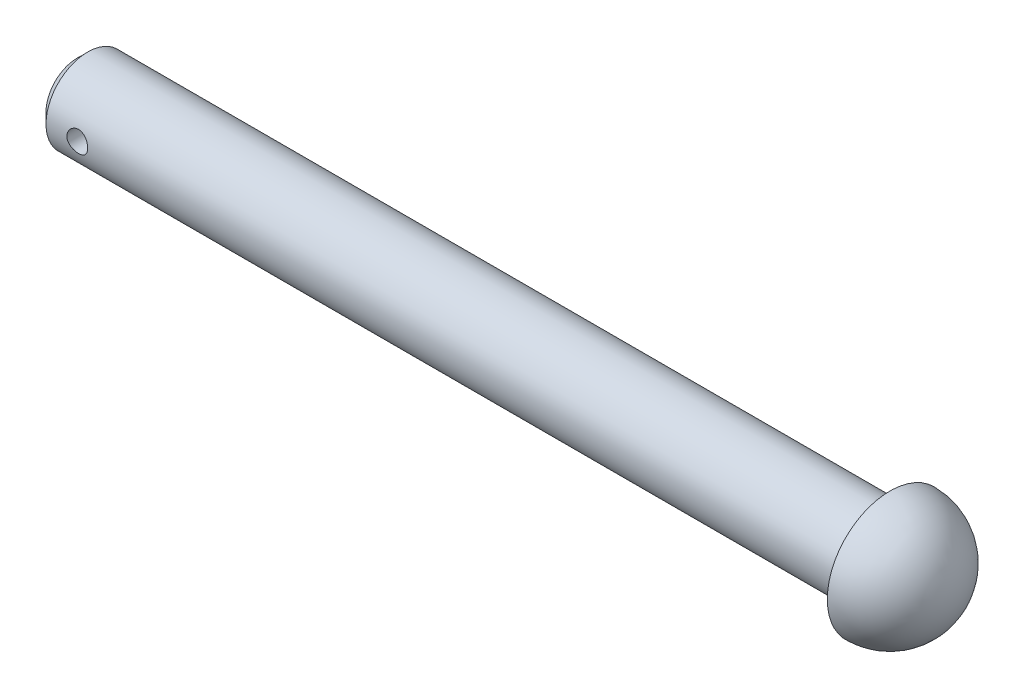
ISO-10303-21;
HEADER;
FILE_DESCRIPTION(('STEP AP214'),'2;1');
FILE_NAME('part.step','',(''),(''),'','','');
FILE_SCHEMA(('AUTOMOTIVE_DESIGN { 1 0 10303 214 1 1 1 1 }'));
ENDSEC;
DATA;
#1=APPLICATION_CONTEXT('core data for automotive mechanical design processes');
#2=APPLICATION_PROTOCOL_DEFINITION('international standard','automotive_design',2000,#1);
#3=PRODUCT_CONTEXT('',#1,'mechanical');
#4=PRODUCT('Part','Part','',(#3));
#5=PRODUCT_RELATED_PRODUCT_CATEGORY('part','',(#4));
#6=PRODUCT_DEFINITION_FORMATION('','',#4);
#7=PRODUCT_DEFINITION_CONTEXT('part definition',#1,'design');
#8=PRODUCT_DEFINITION('design','',#6,#7);
#9=PRODUCT_DEFINITION_SHAPE('','',#8);
#10=(LENGTH_UNIT() NAMED_UNIT(*) SI_UNIT(.MILLI.,.METRE.));
#11=(NAMED_UNIT(*) PLANE_ANGLE_UNIT() SI_UNIT($,.RADIAN.));
#12=(NAMED_UNIT(*) SI_UNIT($,.STERADIAN.) SOLID_ANGLE_UNIT());
#13=UNCERTAINTY_MEASURE_WITH_UNIT(LENGTH_MEASURE(1.E-05),#10,'distance_accuracy_value','');
#14=(GEOMETRIC_REPRESENTATION_CONTEXT(3) GLOBAL_UNCERTAINTY_ASSIGNED_CONTEXT((#13)) GLOBAL_UNIT_ASSIGNED_CONTEXT((#10,
#11,#12)) REPRESENTATION_CONTEXT('',''));
#15=CARTESIAN_POINT('',(0.,0.,0.));
#16=DIRECTION('',(0.,0.,1.));
#17=DIRECTION('',(1.,0.,0.));
#18=AXIS2_PLACEMENT_3D('',#15,#16,#17);
#19=CARTESIAN_POINT('',(-11.4922423671697,0.,0.));
#20=DIRECTION('',(-1.,0.,0.));
#21=DIRECTION('',(0.,0.,1.));
#22=AXIS2_PLACEMENT_3D('',#19,#20,#21);
#23=PLANE('',#22);
#24=CARTESIAN_POINT('',(-11.4922423671697,0.,0.));
#25=DIRECTION('',(-1.,0.,0.));
#26=DIRECTION('',(0.,0.,1.));
#27=AXIS2_PLACEMENT_3D('',#24,#25,#26);
#28=CIRCLE('',#27,1.5);
#29=CARTESIAN_POINT('',(-11.4922423671697,0.,1.5));
#30=VERTEX_POINT('',#29);
#31=EDGE_CURVE('E54',#30,#30,#28,.T.);
#32=ORIENTED_EDGE('',*,*,#31,.T.);
#33=EDGE_LOOP('',(#32));
#34=FACE_BOUND('',#33,.T.);
#35=ADVANCED_FACE('F45',(#34),#23,.T.);
#36=CARTESIAN_POINT('',(-20.421686746988,0.,0.));
#37=DIRECTION('',(-1.,0.,0.));
#38=DIRECTION('',(0.,0.,1.));
#39=AXIS2_PLACEMENT_3D('',#36,#37,#38);
#40=CYLINDRICAL_SURFACE('',#39,2.);
#41=CARTESIAN_POINT('',(-10.9922423671697,0.,0.));
#42=DIRECTION('',(-1.,0.,0.));
#43=DIRECTION('',(0.,0.,1.));
#44=AXIS2_PLACEMENT_3D('',#41,#42,#43);
#45=CIRCLE('',#44,2.);
#46=CARTESIAN_POINT('',(-10.9922423671697,0.,2.));
#47=VERTEX_POINT('',#46);
#48=EDGE_CURVE('E10',#47,#47,#45,.F.);
#49=ORIENTED_EDGE('',*,*,#48,.T.);
#50=EDGE_LOOP('',(#49));
#51=FACE_BOUND('',#50,.T.);
#52=CARTESIAN_POINT('',(-8.99224236716964,0.,2.));
#53=CARTESIAN_POINT('',(-8.9922431424157,0.0276253628899104,1.99999953289338));
#54=CARTESIAN_POINT('',(-8.99453955076091,0.0552593859435878,1.99942192710609));
#55=CARTESIAN_POINT('',(-9.00365075093864,0.109735441256844,1.99717371276631));
#56=CARTESIAN_POINT('',(-9.01046810368226,0.13657701562358,1.99550248473323));
#57=CARTESIAN_POINT('',(-9.02838878499034,0.188673624060859,1.99125208777347));
#58=CARTESIAN_POINT('',(-9.0394869667414,0.213930521143335,1.98867400947362));
#59=CARTESIAN_POINT('',(-9.06563616385125,0.262224043968142,1.98288447935864));
#60=CARTESIAN_POINT('',(-9.08068731254262,0.28526059478292,1.97967300618017));
#61=CARTESIAN_POINT('',(-9.11464263038771,0.328933975766973,1.97289137863934));
#62=CARTESIAN_POINT('',(-9.13361289215604,0.34951856335369,1.96931569049511));
#63=CARTESIAN_POINT('',(-9.17472643547261,0.387249642401101,1.96224540039176));
#64=CARTESIAN_POINT('',(-9.19687007481847,0.404395745649712,1.95875080762783));
#65=CARTESIAN_POINT('',(-9.24410744274879,0.435008847599677,1.9521825856657));
#66=CARTESIAN_POINT('',(-9.26924011077311,0.448417405308452,1.94911598156868));
#67=CARTESIAN_POINT('',(-9.32149183772243,0.470798969516843,1.94383164937408));
#68=CARTESIAN_POINT('',(-9.34861057827823,0.479772685146445,1.94161378557596));
#69=CARTESIAN_POINT('',(-9.4034901999038,0.492851612268098,1.93833492239184));
#70=CARTESIAN_POINT('',(-9.43122733251958,0.497050756111114,1.93725163691809));
#71=CARTESIAN_POINT('',(-9.48703189017431,0.500753925022618,1.9362978751258));
#72=CARTESIAN_POINT('',(-9.51509926073585,0.500258713939327,1.93642720149548));
#73=CARTESIAN_POINT('',(-9.5700476364178,0.494662174879761,1.93786401832206));
#74=CARTESIAN_POINT('',(-9.59694090765801,0.489672780063508,1.93914287667293));
#75=CARTESIAN_POINT('',(-9.64949605080674,0.475408062301036,1.94268903225495));
#76=CARTESIAN_POINT('',(-9.67515783484597,0.466132434023142,1.94495639990232));
#77=CARTESIAN_POINT('',(-9.72482170592033,0.443463159312385,1.95025037968062));
#78=CARTESIAN_POINT('',(-9.74880442443283,0.430028889077638,1.95328442489807));
#79=CARTESIAN_POINT('',(-9.79421527042192,0.399452092004985,1.95976570282129));
#80=CARTESIAN_POINT('',(-9.81564294985873,0.382308916269613,1.96321300778245));
#81=CARTESIAN_POINT('',(-9.85597690573444,0.344221141560406,1.9702529351326));
#82=CARTESIAN_POINT('',(-9.87479386385676,0.323182086055287,1.9738468982599));
#83=CARTESIAN_POINT('',(-9.90864944799095,0.278203972501234,1.98068655192929));
#84=CARTESIAN_POINT('',(-9.92368795859083,0.254264825902648,1.98393223183138));
#85=CARTESIAN_POINT('',(-9.94959256257777,0.204038629560464,1.98972577364727));
#86=CARTESIAN_POINT('',(-9.96044414725445,0.177743797736208,1.99227120042575));
#87=CARTESIAN_POINT('',(-9.9775481357395,0.123625336047628,1.99635972330473));
#88=CARTESIAN_POINT('',(-9.98380141930902,0.095801999716828,1.99790301113094));
#89=CARTESIAN_POINT('',(-9.99139488902259,0.0401799901300085,1.99978499757125));
#90=CARTESIAN_POINT('',(-9.99285670919474,0.0123989066627362,2.00015351169426));
#91=CARTESIAN_POINT('',(-9.99115936648448,-0.0430109582671696,1.9997293493815));
#92=CARTESIAN_POINT('',(-9.98800061956993,-0.0706397532148651,1.99893677747282));
#93=CARTESIAN_POINT('',(-9.97725206437252,-0.124538089592164,1.99629860375786));
#94=CARTESIAN_POINT('',(-9.96972861267732,-0.150821706322918,1.99446878061937));
#95=CARTESIAN_POINT('',(-9.95054000582683,-0.201752430817504,1.98996235544711));
#96=CARTESIAN_POINT('',(-9.93887443239859,-0.226399373010878,1.98728566789964));
#97=CARTESIAN_POINT('',(-9.91149699087807,-0.273841044809949,1.98131102642103));
#98=CARTESIAN_POINT('',(-9.89571699637072,-0.29659514727861,1.97800289122311));
#99=CARTESIAN_POINT('',(-9.86064573090399,-0.339175537881082,1.97114836395806));
#100=CARTESIAN_POINT('',(-9.84135385396401,-0.35900131965767,1.96760193083902));
#101=CARTESIAN_POINT('',(-9.79924171355482,-0.39566352269091,1.96056318986924));
#102=CARTESIAN_POINT('',(-9.77634646616884,-0.412414622540678,1.95707434729094));
#103=CARTESIAN_POINT('',(-9.72799815568107,-0.4418369196709,1.95064292792413));
#104=CARTESIAN_POINT('',(-9.70254520618306,-0.454508298052646,1.94770032689009));
#105=CARTESIAN_POINT('',(-9.64994045969862,-0.475317140203098,1.94272698244888));
#106=CARTESIAN_POINT('',(-9.62279982438831,-0.483481465551356,1.94069085097302));
#107=CARTESIAN_POINT('',(-9.56747248787327,-0.495115219984594,1.93775581363394));
#108=CARTESIAN_POINT('',(-9.53928601682548,-0.49858567582622,1.93685665906645));
#109=CARTESIAN_POINT('',(-9.48353535921791,-0.500679530111332,1.93631633734652));
#110=CARTESIAN_POINT('',(-9.4559765554614,-0.49943929926004,1.93663977576088));
#111=CARTESIAN_POINT('',(-9.40147440428032,-0.492459092770956,1.93842636335948));
#112=CARTESIAN_POINT('',(-9.37453104449843,-0.486719207562257,1.93988948963952));
#113=CARTESIAN_POINT('',(-9.32217288081451,-0.470977106480932,1.94377086894241));
#114=CARTESIAN_POINT('',(-9.29674993208958,-0.461000468226793,1.94618338412103));
#115=CARTESIAN_POINT('',(-9.24792057293175,-0.437088304535025,1.95169251908276));
#116=CARTESIAN_POINT('',(-9.22451444277401,-0.423152230011397,1.95478923373591));
#117=CARTESIAN_POINT('',(-9.1797241575023,-0.391289249545713,1.96141878087837));
#118=CARTESIAN_POINT('',(-9.15840867602832,-0.373267720970752,1.96496088277252));
#119=CARTESIAN_POINT('',(-9.11906001890451,-0.333929790396579,1.97202675748762));
#120=CARTESIAN_POINT('',(-9.10102762379865,-0.312612607087049,1.97555052575686));
#121=CARTESIAN_POINT('',(-9.06843859764811,-0.266822528900864,1.98225885215888));
#122=CARTESIAN_POINT('',(-9.05395082927912,-0.242299474105463,1.98543611121956));
#123=CARTESIAN_POINT('',(-9.02932654618947,-0.191088686503492,1.99101641658373));
#124=CARTESIAN_POINT('',(-9.01918691362013,-0.16440252114558,1.9934200173326));
#125=CARTESIAN_POINT('',(-9.00505175705976,-0.114803417747824,1.99682686521847));
#126=CARTESIAN_POINT('',(-9.00025861948516,-0.092126723636023,1.9980086168423));
#127=CARTESIAN_POINT('',(-8.99385371929566,-0.0463020238454279,1.99959535077316));
#128=CARTESIAN_POINT('',(-8.99224171740121,-0.0231540537475388,2.00000039150298));
#129=CARTESIAN_POINT('',(-8.99224236716964,0.,2.));
#130=B_SPLINE_CURVE_WITH_KNOTS('',3,(#52,#53,#54,#55,#56,#57,#58,#59,#60,#61,#62,#63,#64,#65,
#66,#67,#68,#69,#70,#71,#72,#73,#74,#75,#76,#77,#78,#79,#80,#81,#82,#83,#84,#85,#86,#87,#88,#89,
#90,#91,#92,#93,#94,#95,#96,#97,#98,#99,#100,#101,#102,#103,#104,#105,#106,#107,#108,#109,#110,
#111,#112,#113,#114,#115,#116,#117,#118,#119,#120,#121,#122,#123,#124,#125,#126,#127,#128,#129),
.UNSPECIFIED.,.T.,.F.,(4,2,2,2,2,2,2,2,2,2,2,2,2,2,2,2,2,2,2,2,2,2,2,2,2,2,2,2,2,2,2,2,2,2,2,2,
2,2,4),(0.,0.08279123749063,0.165629412587966,0.248368300762035,0.331109980056443,
0.415381451457129,0.499662431933539,0.585195491819355,0.670714870564561,0.75452098366477,
0.838313460375658,0.920074990023394,1.0018423448868,1.08443509291293,1.16704230278721,
1.25200500323007,1.33697029852749,1.42222743003038,1.50746824562881,1.59052769649759,
1.67357967037581,1.75540091504679,1.83723042440764,1.92051195855117,2.0038078766934,
2.08914836401492,2.17448506249836,2.25930751538012,2.34411141084136,2.42647926799538,
2.50884546985345,2.59072133519816,2.67260856045634,2.75663192136637,2.84067523256806,
2.92624061833196,3.01174454607117,3.08114080980717,3.1505318534768),.UNSPECIFIED.);
#131=CARTESIAN_POINT('',(-8.99224236716964,0.,2.));
#132=VERTEX_POINT('',#131);
#133=EDGE_CURVE('E67',#132,#132,#130,.T.);
#134=ORIENTED_EDGE('',*,*,#133,.F.);
#135=EDGE_LOOP('',(#134));
#136=FACE_BOUND('',#135,.T.);
#137=CARTESIAN_POINT('',(-8.99224236716964,0.,-2.));
#138=CARTESIAN_POINT('',(-8.9922431424157,-0.0276253628899104,-1.99999953289338));
#139=CARTESIAN_POINT('',(-8.99453955076091,-0.0552593859435878,-1.99942192710609));
#140=CARTESIAN_POINT('',(-9.00365075093864,-0.109735441256844,-1.99717371276631));
#141=CARTESIAN_POINT('',(-9.01046810368226,-0.13657701562358,-1.99550248473323));
#142=CARTESIAN_POINT('',(-9.02838878499034,-0.188673624060859,-1.99125208777347));
#143=CARTESIAN_POINT('',(-9.0394869667414,-0.213930521143335,-1.98867400947362));
#144=CARTESIAN_POINT('',(-9.06563616385125,-0.262224043968142,-1.98288447935864));
#145=CARTESIAN_POINT('',(-9.08068731254262,-0.28526059478292,-1.97967300618017));
#146=CARTESIAN_POINT('',(-9.11464263038771,-0.328933975766973,-1.97289137863934));
#147=CARTESIAN_POINT('',(-9.13361289215604,-0.34951856335369,-1.96931569049511));
#148=CARTESIAN_POINT('',(-9.17472643547261,-0.387249642401101,-1.96224540039176));
#149=CARTESIAN_POINT('',(-9.19687007481847,-0.404395745649712,-1.95875080762783));
#150=CARTESIAN_POINT('',(-9.24410744274879,-0.435008847599677,-1.9521825856657));
#151=CARTESIAN_POINT('',(-9.26924011077311,-0.448417405308452,-1.94911598156868));
#152=CARTESIAN_POINT('',(-9.32149183772243,-0.470798969516843,-1.94383164937408));
#153=CARTESIAN_POINT('',(-9.34861057827823,-0.479772685146445,-1.94161378557596));
#154=CARTESIAN_POINT('',(-9.4034901999038,-0.492851612268098,-1.93833492239184));
#155=CARTESIAN_POINT('',(-9.43122733251958,-0.497050756111114,-1.93725163691809));
#156=CARTESIAN_POINT('',(-9.48703189017431,-0.500753925022618,-1.9362978751258));
#157=CARTESIAN_POINT('',(-9.51509926073585,-0.500258713939327,-1.93642720149548));
#158=CARTESIAN_POINT('',(-9.5700476364178,-0.494662174879761,-1.93786401832206));
#159=CARTESIAN_POINT('',(-9.59694090765801,-0.489672780063508,-1.93914287667293));
#160=CARTESIAN_POINT('',(-9.64949605080674,-0.475408062301036,-1.94268903225495));
#161=CARTESIAN_POINT('',(-9.67515783484597,-0.466132434023142,-1.94495639990232));
#162=CARTESIAN_POINT('',(-9.72482170592033,-0.443463159312385,-1.95025037968062));
#163=CARTESIAN_POINT('',(-9.74880442443283,-0.430028889077638,-1.95328442489807));
#164=CARTESIAN_POINT('',(-9.79421527042192,-0.399452092004985,-1.95976570282129));
#165=CARTESIAN_POINT('',(-9.81564294985873,-0.382308916269613,-1.96321300778245));
#166=CARTESIAN_POINT('',(-9.85597690573444,-0.344221141560406,-1.9702529351326));
#167=CARTESIAN_POINT('',(-9.87479386385676,-0.323182086055287,-1.9738468982599));
#168=CARTESIAN_POINT('',(-9.90864944799095,-0.278203972501234,-1.98068655192929));
#169=CARTESIAN_POINT('',(-9.92368795859083,-0.254264825902648,-1.98393223183138));
#170=CARTESIAN_POINT('',(-9.94959256257777,-0.204038629560464,-1.98972577364727));
#171=CARTESIAN_POINT('',(-9.96044414725445,-0.177743797736208,-1.99227120042575));
#172=CARTESIAN_POINT('',(-9.9775481357395,-0.123625336047628,-1.99635972330473));
#173=CARTESIAN_POINT('',(-9.98380141930902,-0.095801999716828,-1.99790301113094));
#174=CARTESIAN_POINT('',(-9.99139488902259,-0.0401799901300085,-1.99978499757125));
#175=CARTESIAN_POINT('',(-9.99285670919474,-0.0123989066627362,-2.00015351169426));
#176=CARTESIAN_POINT('',(-9.99115936648448,0.0430109582671696,-1.9997293493815));
#177=CARTESIAN_POINT('',(-9.98800061956993,0.0706397532148651,-1.99893677747282));
#178=CARTESIAN_POINT('',(-9.97725206437252,0.124538089592164,-1.99629860375786));
#179=CARTESIAN_POINT('',(-9.96972861267732,0.150821706322918,-1.99446878061937));
#180=CARTESIAN_POINT('',(-9.95054000582683,0.201752430817504,-1.98996235544711));
#181=CARTESIAN_POINT('',(-9.93887443239859,0.226399373010878,-1.98728566789964));
#182=CARTESIAN_POINT('',(-9.91149699087807,0.273841044809949,-1.98131102642103));
#183=CARTESIAN_POINT('',(-9.89571699637072,0.29659514727861,-1.97800289122311));
#184=CARTESIAN_POINT('',(-9.86064573090399,0.339175537881082,-1.97114836395806));
#185=CARTESIAN_POINT('',(-9.84135385396401,0.35900131965767,-1.96760193083902));
#186=CARTESIAN_POINT('',(-9.79924171355482,0.39566352269091,-1.96056318986924));
#187=CARTESIAN_POINT('',(-9.77634646616884,0.412414622540678,-1.95707434729094));
#188=CARTESIAN_POINT('',(-9.72799815568107,0.4418369196709,-1.95064292792413));
#189=CARTESIAN_POINT('',(-9.70254520618306,0.454508298052646,-1.94770032689009));
#190=CARTESIAN_POINT('',(-9.64994045969862,0.475317140203098,-1.94272698244888));
#191=CARTESIAN_POINT('',(-9.62279982438831,0.483481465551356,-1.94069085097302));
#192=CARTESIAN_POINT('',(-9.56747248787327,0.495115219984594,-1.93775581363394));
#193=CARTESIAN_POINT('',(-9.53928601682548,0.49858567582622,-1.93685665906645));
#194=CARTESIAN_POINT('',(-9.48353535921791,0.500679530111332,-1.93631633734652));
#195=CARTESIAN_POINT('',(-9.4559765554614,0.49943929926004,-1.93663977576088));
#196=CARTESIAN_POINT('',(-9.40147440428032,0.492459092770956,-1.93842636335948));
#197=CARTESIAN_POINT('',(-9.37453104449843,0.486719207562257,-1.93988948963952));
#198=CARTESIAN_POINT('',(-9.32217288081451,0.470977106480932,-1.94377086894241));
#199=CARTESIAN_POINT('',(-9.29674993208958,0.461000468226793,-1.94618338412103));
#200=CARTESIAN_POINT('',(-9.24792057293175,0.437088304535025,-1.95169251908276));
#201=CARTESIAN_POINT('',(-9.22451444277401,0.423152230011397,-1.95478923373591));
#202=CARTESIAN_POINT('',(-9.1797241575023,0.391289249545713,-1.96141878087837));
#203=CARTESIAN_POINT('',(-9.15840867602832,0.373267720970752,-1.96496088277252));
#204=CARTESIAN_POINT('',(-9.11906001890451,0.333929790396579,-1.97202675748762));
#205=CARTESIAN_POINT('',(-9.10102762379865,0.312612607087049,-1.97555052575686));
#206=CARTESIAN_POINT('',(-9.06843859764811,0.266822528900864,-1.98225885215888));
#207=CARTESIAN_POINT('',(-9.05395082927912,0.242299474105463,-1.98543611121956));
#208=CARTESIAN_POINT('',(-9.02932654618947,0.191088686503492,-1.99101641658373));
#209=CARTESIAN_POINT('',(-9.01918691362013,0.16440252114558,-1.9934200173326));
#210=CARTESIAN_POINT('',(-9.00505175705976,0.114803417747824,-1.99682686521847));
#211=CARTESIAN_POINT('',(-9.00025861948516,0.092126723636023,-1.9980086168423));
#212=CARTESIAN_POINT('',(-8.99385371929566,0.0463020238454279,-1.99959535077316));
#213=CARTESIAN_POINT('',(-8.99224171740121,0.0231540537475388,-2.00000039150298));
#214=CARTESIAN_POINT('',(-8.99224236716964,0.,-2.));
#215=B_SPLINE_CURVE_WITH_KNOTS('',3,(#137,#138,#139,#140,#141,#142,#143,#144,#145,#146,#147,
#148,#149,#150,#151,#152,#153,#154,#155,#156,#157,#158,#159,#160,#161,#162,#163,#164,#165,#166,
#167,#168,#169,#170,#171,#172,#173,#174,#175,#176,#177,#178,#179,#180,#181,#182,#183,#184,#185,
#186,#187,#188,#189,#190,#191,#192,#193,#194,#195,#196,#197,#198,#199,#200,#201,#202,#203,#204,
#205,#206,#207,#208,#209,#210,#211,#212,#213,#214),.UNSPECIFIED.,.T.,.F.,(4,2,2,2,2,2,2,2,2,2,2,
2,2,2,2,2,2,2,2,2,2,2,2,2,2,2,2,2,2,2,2,2,2,2,2,2,2,2,4),(0.,0.08279123749063,0.165629412587966,
0.248368300762035,0.331109980056443,0.415381451457129,0.499662431933539,0.585195491819355,
0.670714870564561,0.75452098366477,0.838313460375658,0.920074990023394,1.0018423448868,
1.08443509291293,1.16704230278721,1.25200500323007,1.33697029852749,1.42222743003038,
1.50746824562881,1.59052769649759,1.67357967037581,1.75540091504679,1.83723042440764,
1.92051195855117,2.0038078766934,2.08914836401492,2.17448506249836,2.25930751538012,
2.34411141084136,2.42647926799538,2.50884546985345,2.59072133519816,2.67260856045634,
2.75663192136637,2.84067523256806,2.92624061833196,3.01174454607117,3.08114080980717,
3.1505318534768),.UNSPECIFIED.);
#216=CARTESIAN_POINT('',(-8.99224236716964,0.,-2.));
#217=VERTEX_POINT('',#216);
#218=EDGE_CURVE('E76',#217,#217,#215,.T.);
#219=ORIENTED_EDGE('',*,*,#218,.F.);
#220=EDGE_LOOP('',(#219));
#221=FACE_BOUND('',#220,.T.);
#222=CARTESIAN_POINT('',(27.5077576328303,0.,0.));
#223=DIRECTION('',(-1.,0.,0.));
#224=DIRECTION('',(0.,0.,1.));
#225=AXIS2_PLACEMENT_3D('',#222,#223,#224);
#226=CIRCLE('',#225,2.);
#227=CARTESIAN_POINT('',(27.5077576328303,0.,2.));
#228=VERTEX_POINT('',#227);
#229=EDGE_CURVE('E59',#228,#228,#226,.T.);
#230=ORIENTED_EDGE('',*,*,#229,.T.);
#231=EDGE_LOOP('',(#230));
#232=FACE_BOUND('',#231,.T.);
#233=ADVANCED_FACE('F80',(#51,#136,#221,#232),#40,.T.);
#234=CARTESIAN_POINT('',(27.5077576328303,-2.,0.));
#235=DIRECTION('',(-1.,0.,0.));
#236=DIRECTION('',(0.,0.,1.));
#237=AXIS2_PLACEMENT_3D('',#234,#235,#236);
#238=PLANE('',#237);
#239=CARTESIAN_POINT('',(27.5077576328304,0.,0.));
#240=DIRECTION('',(-1.,0.,0.));
#241=DIRECTION('',(0.,0.,1.));
#242=AXIS2_PLACEMENT_3D('',#239,#240,#241);
#243=CIRCLE('',#242,3.);
#244=CARTESIAN_POINT('',(27.5077576328304,0.,3.));
#245=VERTEX_POINT('',#244);
#246=EDGE_CURVE('E64',#245,#245,#243,.T.);
#247=ORIENTED_EDGE('',*,*,#246,.T.);
#248=EDGE_LOOP('',(#247));
#249=FACE_BOUND('',#248,.T.);
#250=ORIENTED_EDGE('',*,*,#229,.F.);
#251=EDGE_LOOP('',(#250));
#252=FACE_BOUND('',#251,.T.);
#253=ADVANCED_FACE('F91',(#249,#252),#238,.T.);
#254=CARTESIAN_POINT('',(27.5077576328303,0.,0.));
#255=DIRECTION('',(-1.,0.,0.));
#256=DIRECTION('',(0.,-1.,0.));
#257=AXIS2_PLACEMENT_3D('',#254,#255,#256);
#258=SPHERICAL_SURFACE('',#257,3.);
#259=ORIENTED_EDGE('',*,*,#246,.F.);
#260=EDGE_LOOP('',(#259));
#261=FACE_BOUND('',#260,.T.);
#262=ADVANCED_FACE('F87',(#261),#258,.T.);
#263=CARTESIAN_POINT('',(-9.49224236716964,0.,-5.));
#264=DIRECTION('',(0.,0.,1.));
#265=DIRECTION('',(1.,0.,0.));
#266=AXIS2_PLACEMENT_3D('',#263,#264,#265);
#267=CYLINDRICAL_SURFACE('',#266,0.500000000000001);
#268=ORIENTED_EDGE('',*,*,#133,.T.);
#269=EDGE_LOOP('',(#268));
#270=FACE_BOUND('',#269,.T.);
#271=ORIENTED_EDGE('',*,*,#218,.T.);
#272=EDGE_LOOP('',(#271));
#273=FACE_BOUND('',#272,.T.);
#274=ADVANCED_FACE('F83',(#270,#273),#267,.F.);
#275=CARTESIAN_POINT('',(-11.4922423671697,0.,0.));
#276=DIRECTION('',(1.,0.,0.));
#277=DIRECTION('',(0.,0.,-1.));
#278=AXIS2_PLACEMENT_3D('',#275,#276,#277);
#279=CONICAL_SURFACE('',#278,1.5,0.785398163397448);
#280=ORIENTED_EDGE('',*,*,#48,.F.);
#281=EDGE_LOOP('',(#280));
#282=FACE_BOUND('',#281,.T.);
#283=ORIENTED_EDGE('',*,*,#31,.F.);
#284=EDGE_LOOP('',(#283));
#285=FACE_BOUND('',#284,.T.);
#286=ADVANCED_FACE('F48',(#282,#285),#279,.T.);
#287=CLOSED_SHELL('',(#35,#233,#253,#262,#274,#286));
#288=MANIFOLD_SOLID_BREP('B2',#287);
#289=ADVANCED_BREP_SHAPE_REPRESENTATION('',(#18,#288),#14);
#290=SHAPE_DEFINITION_REPRESENTATION(#9,#289);
ENDSEC;
END-ISO-10303-21;
